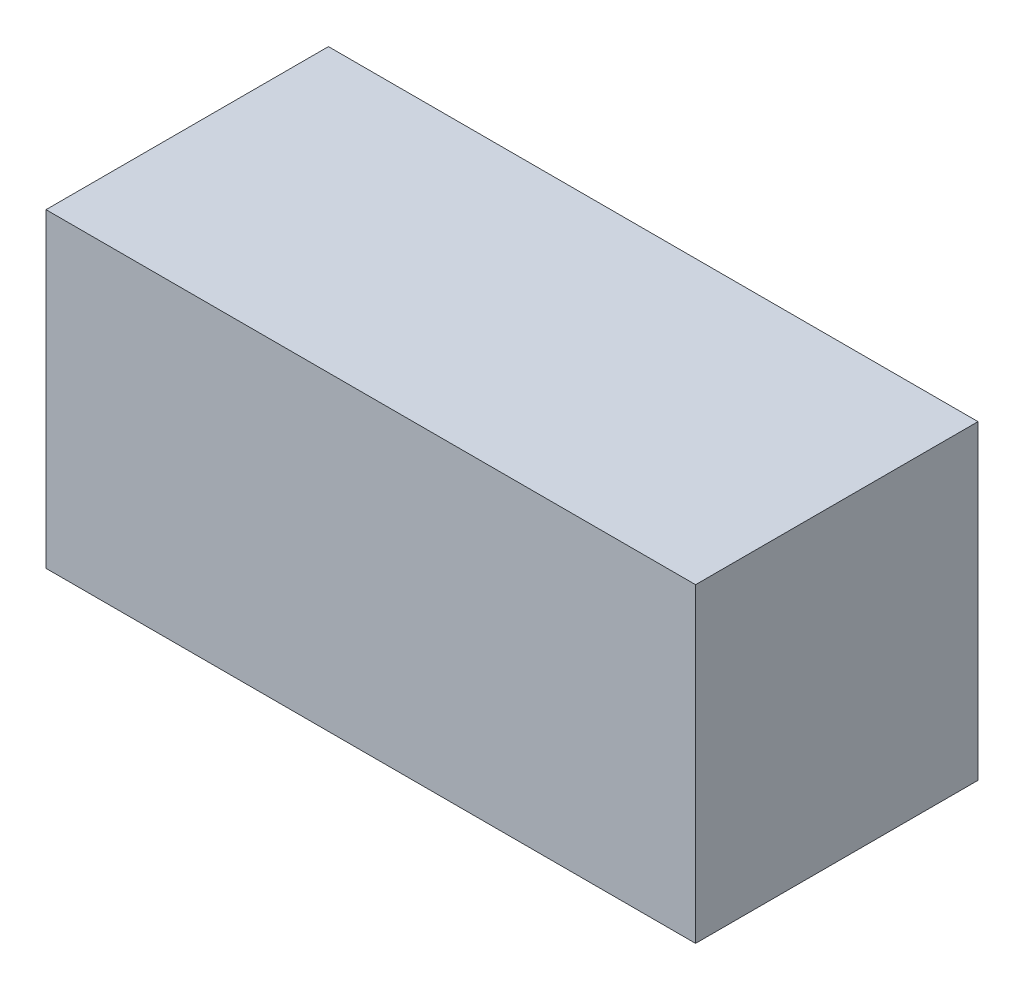
ISO-10303-21;
HEADER;
FILE_DESCRIPTION(('STEP AP214'),'2;1');
FILE_NAME('part.step','',(''),(''),'','','');
FILE_SCHEMA(('AUTOMOTIVE_DESIGN { 1 0 10303 214 1 1 1 1 }'));
ENDSEC;
DATA;
#1=APPLICATION_CONTEXT('core data for automotive mechanical design processes');
#2=APPLICATION_PROTOCOL_DEFINITION('international standard','automotive_design',2000,#1);
#3=PRODUCT_CONTEXT('',#1,'mechanical');
#4=PRODUCT('Part','Part','',(#3));
#5=PRODUCT_RELATED_PRODUCT_CATEGORY('part','',(#4));
#6=PRODUCT_DEFINITION_FORMATION('','',#4);
#7=PRODUCT_DEFINITION_CONTEXT('part definition',#1,'design');
#8=PRODUCT_DEFINITION('design','',#6,#7);
#9=PRODUCT_DEFINITION_SHAPE('','',#8);
#10=(LENGTH_UNIT() NAMED_UNIT(*) SI_UNIT(.MILLI.,.METRE.));
#11=(NAMED_UNIT(*) PLANE_ANGLE_UNIT() SI_UNIT($,.RADIAN.));
#12=(NAMED_UNIT(*) SI_UNIT($,.STERADIAN.) SOLID_ANGLE_UNIT());
#13=UNCERTAINTY_MEASURE_WITH_UNIT(LENGTH_MEASURE(1.E-05),#10,'distance_accuracy_value','');
#14=(GEOMETRIC_REPRESENTATION_CONTEXT(3) GLOBAL_UNCERTAINTY_ASSIGNED_CONTEXT((#13)) GLOBAL_UNIT_ASSIGNED_CONTEXT((#10,
#11,#12)) REPRESENTATION_CONTEXT('',''));
#15=CARTESIAN_POINT('',(0.,0.,0.));
#16=DIRECTION('',(0.,0.,1.));
#17=DIRECTION('',(1.,0.,0.));
#18=AXIS2_PLACEMENT_3D('',#15,#16,#17);
#19=CARTESIAN_POINT('',(0.57500012,0.27500072,0.499999));
#20=DIRECTION('',(0.,0.,1.));
#21=DIRECTION('',(1.,0.,0.));
#22=AXIS2_PLACEMENT_3D('',#19,#20,#21);
#23=PLANE('',#22);
#24=DIRECTION('',(1.,0.,0.));
#25=VECTOR('',#24,1.);
#26=CARTESIAN_POINT('',(0.57500012,-0.27499818,0.499999));
#27=LINE('',#26,#25);
#28=CARTESIAN_POINT('',(0.57500012,-0.27499818,0.499999));
#29=VERTEX_POINT('',#28);
#30=CARTESIAN_POINT('',(-0.57499758,-0.27499818,0.499999));
#31=VERTEX_POINT('',#30);
#32=EDGE_CURVE('E53',#29,#31,#27,.F.);
#33=ORIENTED_EDGE('',*,*,#32,.F.);
#34=DIRECTION('',(0.,1.,0.));
#35=VECTOR('',#34,1.);
#36=CARTESIAN_POINT('',(0.57500012,0.27500072,0.499999));
#37=LINE('',#36,#35);
#38=CARTESIAN_POINT('',(0.57500012,0.27500072,0.499999));
#39=VERTEX_POINT('',#38);
#40=EDGE_CURVE('E68',#39,#29,#37,.F.);
#41=ORIENTED_EDGE('',*,*,#40,.F.);
#42=DIRECTION('',(1.,0.,0.));
#43=VECTOR('',#42,1.);
#44=CARTESIAN_POINT('',(-0.57499758,0.27500072,0.499999));
#45=LINE('',#44,#43);
#46=CARTESIAN_POINT('',(-0.57499758,0.27500072,0.499999));
#47=VERTEX_POINT('',#46);
#48=EDGE_CURVE('E20',#47,#39,#45,.T.);
#49=ORIENTED_EDGE('',*,*,#48,.F.);
#50=DIRECTION('',(0.,1.,0.));
#51=VECTOR('',#50,1.);
#52=CARTESIAN_POINT('',(-0.57499758,-0.27499818,0.499999));
#53=LINE('',#52,#51);
#54=EDGE_CURVE('E58',#31,#47,#53,.T.);
#55=ORIENTED_EDGE('',*,*,#54,.F.);
#56=EDGE_LOOP('',(#33,#41,#49,#55));
#57=FACE_BOUND('',#56,.T.);
#58=ADVANCED_FACE('F17',(#57),#23,.T.);
#59=CARTESIAN_POINT('',(-0.57499758,0.27500072,0.));
#60=DIRECTION('',(0.,1.,0.));
#61=DIRECTION('',(0.,0.,1.));
#62=AXIS2_PLACEMENT_3D('',#59,#60,#61);
#63=PLANE('',#62);
#64=DIRECTION('',(0.,0.,-1.));
#65=VECTOR('',#64,1.);
#66=CARTESIAN_POINT('',(0.57500012,0.27500072,0.));
#67=LINE('',#66,#65);
#68=CARTESIAN_POINT('',(0.57500012,0.27500072,0.));
#69=VERTEX_POINT('',#68);
#70=EDGE_CURVE('E79',#69,#39,#67,.F.);
#71=ORIENTED_EDGE('',*,*,#70,.F.);
#72=DIRECTION('',(1.,0.,0.));
#73=VECTOR('',#72,1.);
#74=CARTESIAN_POINT('',(0.57500012,0.27500072,0.));
#75=LINE('',#74,#73);
#76=CARTESIAN_POINT('',(-0.57499758,0.27500072,0.));
#77=VERTEX_POINT('',#76);
#78=EDGE_CURVE('E74',#69,#77,#75,.F.);
#79=ORIENTED_EDGE('',*,*,#78,.T.);
#80=DIRECTION('',(0.,0.,1.));
#81=VECTOR('',#80,1.);
#82=CARTESIAN_POINT('',(-0.57499758,0.27500072,0.));
#83=LINE('',#82,#81);
#84=EDGE_CURVE('E63',#47,#77,#83,.F.);
#85=ORIENTED_EDGE('',*,*,#84,.F.);
#86=ORIENTED_EDGE('',*,*,#48,.T.);
#87=EDGE_LOOP('',(#71,#79,#85,#86));
#88=FACE_BOUND('',#87,.T.);
#89=ADVANCED_FACE('F73',(#88),#63,.T.);
#90=CARTESIAN_POINT('',(-0.57499758,-0.27499818,0.));
#91=DIRECTION('',(-1.,0.,0.));
#92=DIRECTION('',(0.,0.,1.));
#93=AXIS2_PLACEMENT_3D('',#90,#91,#92);
#94=PLANE('',#93);
#95=ORIENTED_EDGE('',*,*,#84,.T.);
#96=DIRECTION('',(0.,1.,0.));
#97=VECTOR('',#96,1.);
#98=CARTESIAN_POINT('',(-0.57499758,0.27500072,0.));
#99=LINE('',#98,#97);
#100=CARTESIAN_POINT('',(-0.57499758,-0.27499818,0.));
#101=VERTEX_POINT('',#100);
#102=EDGE_CURVE('E84',#77,#101,#99,.F.);
#103=ORIENTED_EDGE('',*,*,#102,.T.);
#104=DIRECTION('',(0.,0.,-1.));
#105=VECTOR('',#104,1.);
#106=CARTESIAN_POINT('',(-0.57499758,-0.27499818,0.));
#107=LINE('',#106,#105);
#108=EDGE_CURVE('E65',#31,#101,#107,.T.);
#109=ORIENTED_EDGE('',*,*,#108,.F.);
#110=ORIENTED_EDGE('',*,*,#54,.T.);
#111=EDGE_LOOP('',(#95,#103,#109,#110));
#112=FACE_BOUND('',#111,.T.);
#113=ADVANCED_FACE('F60',(#112),#94,.T.);
#114=CARTESIAN_POINT('',(0.57500012,-0.27499818,0.));
#115=DIRECTION('',(0.,-1.,0.));
#116=DIRECTION('',(0.,0.,-1.));
#117=AXIS2_PLACEMENT_3D('',#114,#115,#116);
#118=PLANE('',#117);
#119=ORIENTED_EDGE('',*,*,#108,.T.);
#120=DIRECTION('',(1.,0.,0.));
#121=VECTOR('',#120,1.);
#122=CARTESIAN_POINT('',(0.57500012,-0.27499818,0.));
#123=LINE('',#122,#121);
#124=CARTESIAN_POINT('',(0.57500012,-0.27499818,0.));
#125=VERTEX_POINT('',#124);
#126=EDGE_CURVE('E26',#101,#125,#123,.T.);
#127=ORIENTED_EDGE('',*,*,#126,.T.);
#128=DIRECTION('',(0.,0.,-1.));
#129=VECTOR('',#128,1.);
#130=CARTESIAN_POINT('',(0.57500012,-0.27499818,0.));
#131=LINE('',#130,#129);
#132=EDGE_CURVE('E34',#29,#125,#131,.T.);
#133=ORIENTED_EDGE('',*,*,#132,.F.);
#134=ORIENTED_EDGE('',*,*,#32,.T.);
#135=EDGE_LOOP('',(#119,#127,#133,#134));
#136=FACE_BOUND('',#135,.T.);
#137=ADVANCED_FACE('F88',(#136),#118,.T.);
#138=CARTESIAN_POINT('',(0.57500012,0.27500072,0.));
#139=DIRECTION('',(1.,0.,0.));
#140=DIRECTION('',(0.,0.,-1.));
#141=AXIS2_PLACEMENT_3D('',#138,#139,#140);
#142=PLANE('',#141);
#143=ORIENTED_EDGE('',*,*,#132,.T.);
#144=DIRECTION('',(0.,1.,0.));
#145=VECTOR('',#144,1.);
#146=CARTESIAN_POINT('',(0.57500012,0.27500072,0.));
#147=LINE('',#146,#145);
#148=EDGE_CURVE('E11',#125,#69,#147,.T.);
#149=ORIENTED_EDGE('',*,*,#148,.T.);
#150=ORIENTED_EDGE('',*,*,#70,.T.);
#151=ORIENTED_EDGE('',*,*,#40,.T.);
#152=EDGE_LOOP('',(#143,#149,#150,#151));
#153=FACE_BOUND('',#152,.T.);
#154=ADVANCED_FACE('F91',(#153),#142,.T.);
#155=CARTESIAN_POINT('',(0.57500012,0.27500072,0.));
#156=DIRECTION('',(0.,0.,1.));
#157=DIRECTION('',(1.,0.,0.));
#158=AXIS2_PLACEMENT_3D('',#155,#156,#157);
#159=PLANE('',#158);
#160=ORIENTED_EDGE('',*,*,#126,.F.);
#161=ORIENTED_EDGE('',*,*,#102,.F.);
#162=ORIENTED_EDGE('',*,*,#78,.F.);
#163=ORIENTED_EDGE('',*,*,#148,.F.);
#164=EDGE_LOOP('',(#160,#161,#162,#163));
#165=FACE_BOUND('',#164,.T.);
#166=ADVANCED_FACE('F90',(#165),#159,.F.);
#167=CLOSED_SHELL('',(#58,#89,#113,#137,#154,#166));
#168=MANIFOLD_SOLID_BREP('B1',#167);
#169=ADVANCED_BREP_SHAPE_REPRESENTATION('',(#18,#168),#14);
#170=SHAPE_DEFINITION_REPRESENTATION(#9,#169);
ENDSEC;
END-ISO-10303-21;
